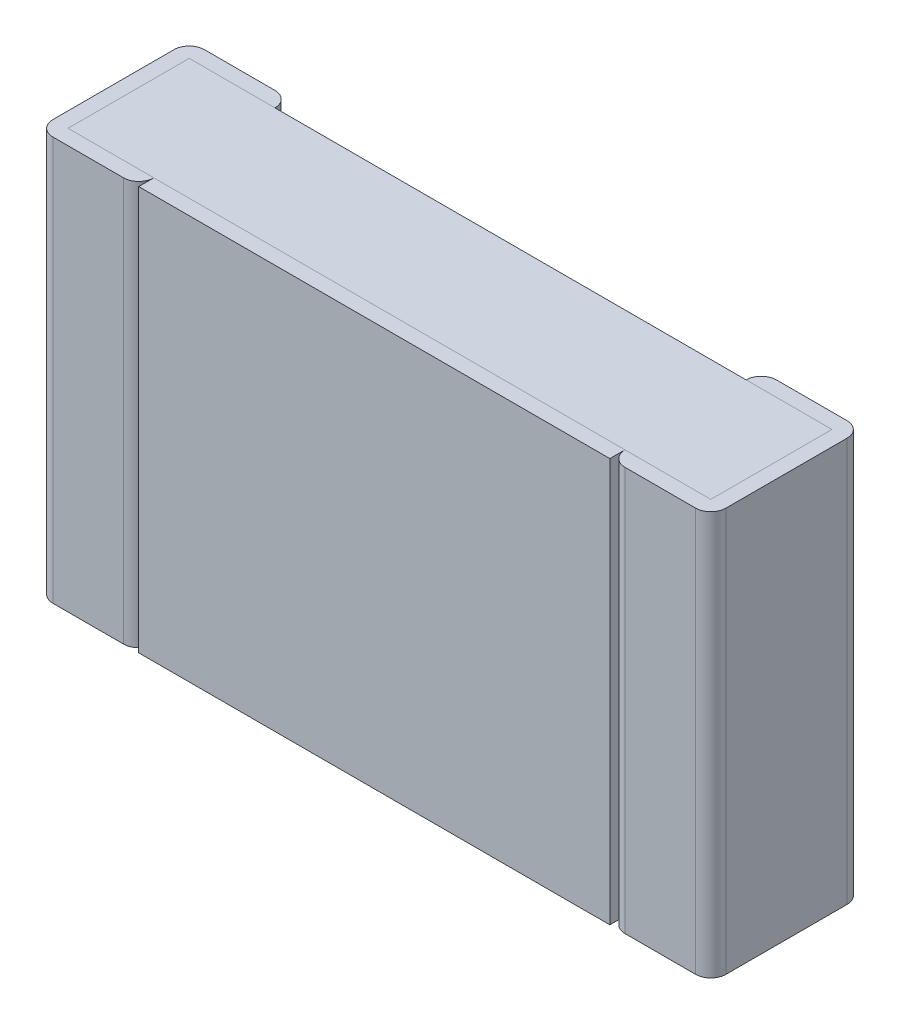
ISO-10303-21;
HEADER;
FILE_DESCRIPTION(('STEP AP214'),'2;1');
FILE_NAME('part.step','',(''),(''),'','','');
FILE_SCHEMA(('AUTOMOTIVE_DESIGN { 1 0 10303 214 1 1 1 1 }'));
ENDSEC;
DATA;
#1=APPLICATION_CONTEXT('core data for automotive mechanical design processes');
#2=APPLICATION_PROTOCOL_DEFINITION('international standard','automotive_design',2000,#1);
#3=PRODUCT_CONTEXT('',#1,'mechanical');
#4=PRODUCT('Part','Part','',(#3));
#5=PRODUCT_RELATED_PRODUCT_CATEGORY('part','',(#4));
#6=PRODUCT_DEFINITION_FORMATION('','',#4);
#7=PRODUCT_DEFINITION_CONTEXT('part definition',#1,'design');
#8=PRODUCT_DEFINITION('design','',#6,#7);
#9=PRODUCT_DEFINITION_SHAPE('','',#8);
#10=(LENGTH_UNIT() NAMED_UNIT(*) SI_UNIT(.MILLI.,.METRE.));
#11=(NAMED_UNIT(*) PLANE_ANGLE_UNIT() SI_UNIT($,.RADIAN.));
#12=(NAMED_UNIT(*) SI_UNIT($,.STERADIAN.) SOLID_ANGLE_UNIT());
#13=UNCERTAINTY_MEASURE_WITH_UNIT(LENGTH_MEASURE(1.E-05),#10,'distance_accuracy_value','');
#14=(GEOMETRIC_REPRESENTATION_CONTEXT(3) GLOBAL_UNCERTAINTY_ASSIGNED_CONTEXT((#13)) GLOBAL_UNIT_ASSIGNED_CONTEXT((#10,
#11,#12)) REPRESENTATION_CONTEXT('',''));
#15=CARTESIAN_POINT('',(0.,0.,0.));
#16=DIRECTION('',(0.,0.,1.));
#17=DIRECTION('',(1.,0.,0.));
#18=AXIS2_PLACEMENT_3D('',#15,#16,#17);
#19=CARTESIAN_POINT('',(-1.,-0.6,0.));
#20=DIRECTION('',(1.,0.,0.));
#21=DIRECTION('',(0.,1.,0.));
#22=AXIS2_PLACEMENT_3D('',#19,#20,#21);
#23=PLANE('',#22);
#24=DIRECTION('',(0.,1.,0.));
#25=VECTOR('',#24,1.);
#26=CARTESIAN_POINT('',(-1.,-0.6,0.405));
#27=LINE('',#26,#25);
#28=CARTESIAN_POINT('',(-1.,-0.6,0.405));
#29=VERTEX_POINT('',#28);
#30=CARTESIAN_POINT('',(-1.,0.6,0.405));
#31=VERTEX_POINT('',#30);
#32=EDGE_CURVE('E11',#29,#31,#27,.T.);
#33=ORIENTED_EDGE('',*,*,#32,.T.);
#34=DIRECTION('',(0.,0.,1.));
#35=VECTOR('',#34,1.);
#36=CARTESIAN_POINT('',(-1.,0.6,0.));
#37=LINE('',#36,#35);
#38=CARTESIAN_POINT('',(-1.,0.6,0.045));
#39=VERTEX_POINT('',#38);
#40=EDGE_CURVE('E41',#39,#31,#37,.T.);
#41=ORIENTED_EDGE('',*,*,#40,.F.);
#42=DIRECTION('',(0.,1.,0.));
#43=VECTOR('',#42,1.);
#44=CARTESIAN_POINT('',(-1.,-0.6,0.045));
#45=LINE('',#44,#43);
#46=CARTESIAN_POINT('',(-1.,-0.6,0.045));
#47=VERTEX_POINT('',#46);
#48=EDGE_CURVE('E280',#47,#39,#45,.T.);
#49=ORIENTED_EDGE('',*,*,#48,.F.);
#50=DIRECTION('',(0.,0.,1.));
#51=VECTOR('',#50,1.);
#52=CARTESIAN_POINT('',(-1.,-0.6,0.));
#53=LINE('',#52,#51);
#54=EDGE_CURVE('E27',#47,#29,#53,.T.);
#55=ORIENTED_EDGE('',*,*,#54,.T.);
#56=EDGE_LOOP('',(#33,#41,#49,#55));
#57=FACE_BOUND('',#56,.T.);
#58=ADVANCED_FACE('F16',(#57),#23,.F.);
#59=CARTESIAN_POINT('',(-1.,-0.6,0.));
#60=DIRECTION('',(0.,1.,0.));
#61=DIRECTION('',(1.,0.,0.));
#62=AXIS2_PLACEMENT_3D('',#59,#60,#61);
#63=PLANE('',#62);
#64=CARTESIAN_POINT('',(-0.745,-0.6,0.045));
#65=DIRECTION('',(0.,1.,0.));
#66=DIRECTION('',(0.,0.,1.));
#67=AXIS2_PLACEMENT_3D('',#64,#65,#66);
#68=CIRCLE('',#67,0.045);
#69=CARTESIAN_POINT('',(-0.7,-0.6,0.045));
#70=VERTEX_POINT('',#69);
#71=CARTESIAN_POINT('',(-0.745,-0.6,0.));
#72=VERTEX_POINT('',#71);
#73=EDGE_CURVE('E273',#70,#72,#68,.T.);
#74=ORIENTED_EDGE('',*,*,#73,.F.);
#75=DIRECTION('',(1.,0.,0.));
#76=VECTOR('',#75,1.);
#77=CARTESIAN_POINT('',(-0.955,-0.6,0.045));
#78=LINE('',#77,#76);
#79=CARTESIAN_POINT('',(-0.955,-0.6,0.045));
#80=VERTEX_POINT('',#79);
#81=EDGE_CURVE('E221',#80,#70,#78,.T.);
#82=ORIENTED_EDGE('',*,*,#81,.F.);
#83=DIRECTION('',(0.,0.,1.));
#84=VECTOR('',#83,1.);
#85=CARTESIAN_POINT('',(-0.955,-0.6,0.045));
#86=LINE('',#85,#84);
#87=CARTESIAN_POINT('',(-0.955,-0.6,0.405));
#88=VERTEX_POINT('',#87);
#89=EDGE_CURVE('E252',#80,#88,#86,.T.);
#90=ORIENTED_EDGE('',*,*,#89,.T.);
#91=DIRECTION('',(1.,0.,0.));
#92=VECTOR('',#91,1.);
#93=CARTESIAN_POINT('',(-0.955,-0.6,0.405));
#94=LINE('',#93,#92);
#95=CARTESIAN_POINT('',(-0.7,-0.6,0.405));
#96=VERTEX_POINT('',#95);
#97=EDGE_CURVE('E303',#88,#96,#94,.T.);
#98=ORIENTED_EDGE('',*,*,#97,.T.);
#99=CARTESIAN_POINT('',(-0.745,-0.6,0.405));
#100=DIRECTION('',(0.,-1.,0.));
#101=DIRECTION('',(0.,0.,1.));
#102=AXIS2_PLACEMENT_3D('',#99,#100,#101);
#103=CIRCLE('',#102,0.045);
#104=CARTESIAN_POINT('',(-0.745,-0.6,0.45));
#105=VERTEX_POINT('',#104);
#106=EDGE_CURVE('E299',#96,#105,#103,.T.);
#107=ORIENTED_EDGE('',*,*,#106,.T.);
#108=DIRECTION('',(1.,0.,0.));
#109=VECTOR('',#108,1.);
#110=CARTESIAN_POINT('',(-1.,-0.6,0.45));
#111=LINE('',#110,#109);
#112=CARTESIAN_POINT('',(-0.955,-0.6,0.45));
#113=VERTEX_POINT('',#112);
#114=EDGE_CURVE('E226',#113,#105,#111,.T.);
#115=ORIENTED_EDGE('',*,*,#114,.F.);
#116=CARTESIAN_POINT('',(-0.955,-0.6,0.405));
#117=DIRECTION('',(0.,1.,0.));
#118=DIRECTION('',(0.,0.,1.));
#119=AXIS2_PLACEMENT_3D('',#116,#117,#118);
#120=CIRCLE('',#119,0.045);
#121=EDGE_CURVE('E394',#29,#113,#120,.T.);
#122=ORIENTED_EDGE('',*,*,#121,.F.);
#123=ORIENTED_EDGE('',*,*,#54,.F.);
#124=CARTESIAN_POINT('',(-0.955,-0.6,0.045));
#125=DIRECTION('',(0.,-1.,0.));
#126=DIRECTION('',(0.,0.,1.));
#127=AXIS2_PLACEMENT_3D('',#124,#125,#126);
#128=CIRCLE('',#127,0.045);
#129=CARTESIAN_POINT('',(-0.955,-0.6,0.));
#130=VERTEX_POINT('',#129);
#131=EDGE_CURVE('E279',#47,#130,#128,.T.);
#132=ORIENTED_EDGE('',*,*,#131,.T.);
#133=DIRECTION('',(1.,0.,0.));
#134=VECTOR('',#133,1.);
#135=CARTESIAN_POINT('',(-1.,-0.6,0.));
#136=LINE('',#135,#134);
#137=EDGE_CURVE('E275',#130,#72,#136,.T.);
#138=ORIENTED_EDGE('',*,*,#137,.T.);
#139=EDGE_LOOP('',(#74,#82,#90,#98,#107,#115,#122,#123,#132,#138));
#140=FACE_BOUND('',#139,.T.);
#141=ADVANCED_FACE('F510',(#140),#63,.F.);
#142=CARTESIAN_POINT('',(-0.955,-0.6,0.045));
#143=DIRECTION('',(0.,1.,0.));
#144=DIRECTION('',(-1.,0.,0.));
#145=AXIS2_PLACEMENT_3D('',#142,#143,#144);
#146=CYLINDRICAL_SURFACE('',#145,0.045);
#147=ORIENTED_EDGE('',*,*,#48,.T.);
#148=CARTESIAN_POINT('',(-0.955,0.6,0.045));
#149=DIRECTION('',(0.,-1.,0.));
#150=DIRECTION('',(0.,0.,1.));
#151=AXIS2_PLACEMENT_3D('',#148,#149,#150);
#152=CIRCLE('',#151,0.045);
#153=CARTESIAN_POINT('',(-0.955,0.6,0.));
#154=VERTEX_POINT('',#153);
#155=EDGE_CURVE('E407',#39,#154,#152,.T.);
#156=ORIENTED_EDGE('',*,*,#155,.T.);
#157=DIRECTION('',(0.,1.,0.));
#158=VECTOR('',#157,1.);
#159=CARTESIAN_POINT('',(-0.955,-0.6,0.));
#160=LINE('',#159,#158);
#161=EDGE_CURVE('E290',#130,#154,#160,.T.);
#162=ORIENTED_EDGE('',*,*,#161,.F.);
#163=ORIENTED_EDGE('',*,*,#131,.F.);
#164=EDGE_LOOP('',(#147,#156,#162,#163));
#165=FACE_BOUND('',#164,.T.);
#166=ADVANCED_FACE('F531',(#165),#146,.T.);
#167=CARTESIAN_POINT('',(-0.955,-0.6,0.405));
#168=DIRECTION('',(0.,1.,0.));
#169=DIRECTION('',(-1.,0.,0.));
#170=AXIS2_PLACEMENT_3D('',#167,#168,#169);
#171=CYLINDRICAL_SURFACE('',#170,0.045);
#172=ORIENTED_EDGE('',*,*,#121,.T.);
#173=DIRECTION('',(0.,1.,0.));
#174=VECTOR('',#173,1.);
#175=CARTESIAN_POINT('',(-0.955,-0.6,0.45));
#176=LINE('',#175,#174);
#177=CARTESIAN_POINT('',(-0.955,0.6,0.45));
#178=VERTEX_POINT('',#177);
#179=EDGE_CURVE('E370',#113,#178,#176,.T.);
#180=ORIENTED_EDGE('',*,*,#179,.T.);
#181=CARTESIAN_POINT('',(-0.955,0.6,0.405));
#182=DIRECTION('',(0.,1.,0.));
#183=DIRECTION('',(0.,0.,1.));
#184=AXIS2_PLACEMENT_3D('',#181,#182,#183);
#185=CIRCLE('',#184,0.045);
#186=EDGE_CURVE('E247',#31,#178,#185,.T.);
#187=ORIENTED_EDGE('',*,*,#186,.F.);
#188=ORIENTED_EDGE('',*,*,#32,.F.);
#189=EDGE_LOOP('',(#172,#180,#187,#188));
#190=FACE_BOUND('',#189,.T.);
#191=ADVANCED_FACE('F540',(#190),#171,.T.);
#192=CARTESIAN_POINT('',(-1.,0.6,0.));
#193=DIRECTION('',(0.,1.,0.));
#194=DIRECTION('',(1.,0.,0.));
#195=AXIS2_PLACEMENT_3D('',#192,#193,#194);
#196=PLANE('',#195);
#197=DIRECTION('',(1.,0.,0.));
#198=VECTOR('',#197,1.);
#199=CARTESIAN_POINT('',(-1.,0.6,0.));
#200=LINE('',#199,#198);
#201=CARTESIAN_POINT('',(-0.745,0.6,0.));
#202=VERTEX_POINT('',#201);
#203=EDGE_CURVE('E294',#154,#202,#200,.T.);
#204=ORIENTED_EDGE('',*,*,#203,.F.);
#205=ORIENTED_EDGE('',*,*,#155,.F.);
#206=ORIENTED_EDGE('',*,*,#40,.T.);
#207=ORIENTED_EDGE('',*,*,#186,.T.);
#208=DIRECTION('',(1.,0.,0.));
#209=VECTOR('',#208,1.);
#210=CARTESIAN_POINT('',(-1.,0.6,0.45));
#211=LINE('',#210,#209);
#212=CARTESIAN_POINT('',(-0.745,0.6,0.45));
#213=VERTEX_POINT('',#212);
#214=EDGE_CURVE('E241',#178,#213,#211,.T.);
#215=ORIENTED_EDGE('',*,*,#214,.T.);
#216=CARTESIAN_POINT('',(-0.745,0.6,0.405));
#217=DIRECTION('',(0.,-1.,0.));
#218=DIRECTION('',(0.,0.,1.));
#219=AXIS2_PLACEMENT_3D('',#216,#217,#218);
#220=CIRCLE('',#219,0.045);
#221=CARTESIAN_POINT('',(-0.7,0.6,0.405));
#222=VERTEX_POINT('',#221);
#223=EDGE_CURVE('E232',#222,#213,#220,.T.);
#224=ORIENTED_EDGE('',*,*,#223,.F.);
#225=DIRECTION('',(1.,0.,0.));
#226=VECTOR('',#225,1.);
#227=CARTESIAN_POINT('',(-0.955,0.6,0.405));
#228=LINE('',#227,#226);
#229=CARTESIAN_POINT('',(-0.955,0.6,0.405));
#230=VERTEX_POINT('',#229);
#231=EDGE_CURVE('E233',#230,#222,#228,.T.);
#232=ORIENTED_EDGE('',*,*,#231,.F.);
#233=DIRECTION('',(0.,0.,1.));
#234=VECTOR('',#233,1.);
#235=CARTESIAN_POINT('',(-0.955,0.6,0.045));
#236=LINE('',#235,#234);
#237=CARTESIAN_POINT('',(-0.955,0.6,0.045));
#238=VERTEX_POINT('',#237);
#239=EDGE_CURVE('E229',#238,#230,#236,.T.);
#240=ORIENTED_EDGE('',*,*,#239,.F.);
#241=DIRECTION('',(1.,0.,0.));
#242=VECTOR('',#241,1.);
#243=CARTESIAN_POINT('',(-0.955,0.6,0.045));
#244=LINE('',#243,#242);
#245=CARTESIAN_POINT('',(-0.7,0.6,0.045));
#246=VERTEX_POINT('',#245);
#247=EDGE_CURVE('E237',#238,#246,#244,.T.);
#248=ORIENTED_EDGE('',*,*,#247,.T.);
#249=CARTESIAN_POINT('',(-0.745,0.6,0.045));
#250=DIRECTION('',(0.,1.,0.));
#251=DIRECTION('',(0.,0.,1.));
#252=AXIS2_PLACEMENT_3D('',#249,#250,#251);
#253=CIRCLE('',#252,0.045);
#254=EDGE_CURVE('E242',#246,#202,#253,.T.);
#255=ORIENTED_EDGE('',*,*,#254,.T.);
#256=EDGE_LOOP('',(#204,#205,#206,#207,#215,#224,#232,#240,#248,#255));
#257=FACE_BOUND('',#256,.T.);
#258=ADVANCED_FACE('F536',(#257),#196,.T.);
#259=CARTESIAN_POINT('',(-1.,-0.6,0.));
#260=DIRECTION('',(0.,0.,1.));
#261=DIRECTION('',(1.,0.,0.));
#262=AXIS2_PLACEMENT_3D('',#259,#260,#261);
#263=PLANE('',#262);
#264=DIRECTION('',(0.,1.,0.));
#265=VECTOR('',#264,1.);
#266=CARTESIAN_POINT('',(-0.745,-0.6,0.));
#267=LINE('',#266,#265);
#268=EDGE_CURVE('E236',#72,#202,#267,.T.);
#269=ORIENTED_EDGE('',*,*,#268,.F.);
#270=ORIENTED_EDGE('',*,*,#137,.F.);
#271=ORIENTED_EDGE('',*,*,#161,.T.);
#272=ORIENTED_EDGE('',*,*,#203,.T.);
#273=EDGE_LOOP('',(#269,#270,#271,#272));
#274=FACE_BOUND('',#273,.T.);
#275=ADVANCED_FACE('F539',(#274),#263,.F.);
#276=CARTESIAN_POINT('',(-0.745,-0.6,0.045));
#277=DIRECTION('',(0.,1.,0.));
#278=DIRECTION('',(1.,0.,0.));
#279=AXIS2_PLACEMENT_3D('',#276,#277,#278);
#280=CYLINDRICAL_SURFACE('',#279,0.045);
#281=ORIENTED_EDGE('',*,*,#73,.T.);
#282=ORIENTED_EDGE('',*,*,#268,.T.);
#283=ORIENTED_EDGE('',*,*,#254,.F.);
#284=DIRECTION('',(0.,1.,0.));
#285=VECTOR('',#284,1.);
#286=CARTESIAN_POINT('',(-0.7,-0.6,0.045));
#287=LINE('',#286,#285);
#288=EDGE_CURVE('E289',#70,#246,#287,.T.);
#289=ORIENTED_EDGE('',*,*,#288,.F.);
#290=EDGE_LOOP('',(#281,#282,#283,#289));
#291=FACE_BOUND('',#290,.T.);
#292=ADVANCED_FACE('F565',(#291),#280,.T.);
#293=CARTESIAN_POINT('',(-0.955,-0.6,0.045));
#294=DIRECTION('',(0.,1.,0.));
#295=DIRECTION('',(1.,0.,0.));
#296=AXIS2_PLACEMENT_3D('',#293,#294,#295);
#297=PLANE('',#296);
#298=DIRECTION('',(1.,0.,0.));
#299=VECTOR('',#298,1.);
#300=CARTESIAN_POINT('',(-0.955,-0.6,0.045));
#301=LINE('',#300,#299);
#302=CARTESIAN_POINT('',(0.7,-0.6,0.045));
#303=VERTEX_POINT('',#302);
#304=EDGE_CURVE('E211',#70,#303,#301,.T.);
#305=ORIENTED_EDGE('',*,*,#304,.T.);
#306=DIRECTION('',(1.,0.,0.));
#307=VECTOR('',#306,1.);
#308=CARTESIAN_POINT('',(-0.955,-0.6,0.045));
#309=LINE('',#308,#307);
#310=CARTESIAN_POINT('',(0.955,-0.6,0.045));
#311=VERTEX_POINT('',#310);
#312=EDGE_CURVE('E203',#303,#311,#309,.T.);
#313=ORIENTED_EDGE('',*,*,#312,.T.);
#314=DIRECTION('',(0.,0.,1.));
#315=VECTOR('',#314,1.);
#316=CARTESIAN_POINT('',(0.955,-0.6,0.045));
#317=LINE('',#316,#315);
#318=CARTESIAN_POINT('',(0.955,-0.6,0.405));
#319=VERTEX_POINT('',#318);
#320=EDGE_CURVE('E207',#311,#319,#317,.T.);
#321=ORIENTED_EDGE('',*,*,#320,.T.);
#322=DIRECTION('',(1.,0.,0.));
#323=VECTOR('',#322,1.);
#324=CARTESIAN_POINT('',(-0.955,-0.6,0.405));
#325=LINE('',#324,#323);
#326=CARTESIAN_POINT('',(0.7,-0.6,0.405));
#327=VERTEX_POINT('',#326);
#328=EDGE_CURVE('E219',#327,#319,#325,.T.);
#329=ORIENTED_EDGE('',*,*,#328,.F.);
#330=DIRECTION('',(1.,0.,0.));
#331=VECTOR('',#330,1.);
#332=CARTESIAN_POINT('',(-0.7,-0.6,0.405));
#333=LINE('',#332,#331);
#334=EDGE_CURVE('E253',#96,#327,#333,.T.);
#335=ORIENTED_EDGE('',*,*,#334,.F.);
#336=ORIENTED_EDGE('',*,*,#97,.F.);
#337=ORIENTED_EDGE('',*,*,#89,.F.);
#338=ORIENTED_EDGE('',*,*,#81,.T.);
#339=EDGE_LOOP('',(#305,#313,#321,#329,#335,#336,#337,#338));
#340=FACE_BOUND('',#339,.T.);
#341=ADVANCED_FACE('F205',(#340),#297,.F.);
#342=CARTESIAN_POINT('',(-1.,-0.6,0.45));
#343=DIRECTION('',(0.,0.,1.));
#344=DIRECTION('',(1.,0.,0.));
#345=AXIS2_PLACEMENT_3D('',#342,#343,#344);
#346=PLANE('',#345);
#347=ORIENTED_EDGE('',*,*,#214,.F.);
#348=ORIENTED_EDGE('',*,*,#179,.F.);
#349=ORIENTED_EDGE('',*,*,#114,.T.);
#350=DIRECTION('',(0.,1.,0.));
#351=VECTOR('',#350,1.);
#352=CARTESIAN_POINT('',(-0.745,-0.6,0.45));
#353=LINE('',#352,#351);
#354=EDGE_CURVE('E382',#105,#213,#353,.T.);
#355=ORIENTED_EDGE('',*,*,#354,.T.);
#356=EDGE_LOOP('',(#347,#348,#349,#355));
#357=FACE_BOUND('',#356,.T.);
#358=ADVANCED_FACE('F564',(#357),#346,.T.);
#359=CARTESIAN_POINT('',(-0.745,-0.6,0.405));
#360=DIRECTION('',(0.,1.,0.));
#361=DIRECTION('',(1.,0.,0.));
#362=AXIS2_PLACEMENT_3D('',#359,#360,#361);
#363=CYLINDRICAL_SURFACE('',#362,0.045);
#364=DIRECTION('',(0.,1.,0.));
#365=VECTOR('',#364,1.);
#366=CARTESIAN_POINT('',(-0.7,-0.6,0.405));
#367=LINE('',#366,#365);
#368=EDGE_CURVE('E362',#96,#222,#367,.T.);
#369=ORIENTED_EDGE('',*,*,#368,.T.);
#370=ORIENTED_EDGE('',*,*,#223,.T.);
#371=ORIENTED_EDGE('',*,*,#354,.F.);
#372=ORIENTED_EDGE('',*,*,#106,.F.);
#373=EDGE_LOOP('',(#369,#370,#371,#372));
#374=FACE_BOUND('',#373,.T.);
#375=ADVANCED_FACE('F507',(#374),#363,.T.);
#376=CARTESIAN_POINT('',(-0.955,0.6,0.045));
#377=DIRECTION('',(0.,1.,0.));
#378=DIRECTION('',(1.,0.,0.));
#379=AXIS2_PLACEMENT_3D('',#376,#377,#378);
#380=PLANE('',#379);
#381=ORIENTED_EDGE('',*,*,#247,.F.);
#382=ORIENTED_EDGE('',*,*,#239,.T.);
#383=ORIENTED_EDGE('',*,*,#231,.T.);
#384=DIRECTION('',(1.,0.,0.));
#385=VECTOR('',#384,1.);
#386=CARTESIAN_POINT('',(-0.7,0.6,0.405));
#387=LINE('',#386,#385);
#388=CARTESIAN_POINT('',(0.7,0.6,0.405));
#389=VERTEX_POINT('',#388);
#390=EDGE_CURVE('E349',#222,#389,#387,.T.);
#391=ORIENTED_EDGE('',*,*,#390,.T.);
#392=DIRECTION('',(1.,0.,0.));
#393=VECTOR('',#392,1.);
#394=CARTESIAN_POINT('',(-0.955,0.6,0.405));
#395=LINE('',#394,#393);
#396=CARTESIAN_POINT('',(0.955,0.6,0.405));
#397=VERTEX_POINT('',#396);
#398=EDGE_CURVE('E411',#389,#397,#395,.T.);
#399=ORIENTED_EDGE('',*,*,#398,.T.);
#400=DIRECTION('',(0.,0.,1.));
#401=VECTOR('',#400,1.);
#402=CARTESIAN_POINT('',(0.955,0.6,0.045));
#403=LINE('',#402,#401);
#404=CARTESIAN_POINT('',(0.955,0.6,0.045));
#405=VERTEX_POINT('',#404);
#406=EDGE_CURVE('E262',#405,#397,#403,.T.);
#407=ORIENTED_EDGE('',*,*,#406,.F.);
#408=DIRECTION('',(1.,0.,0.));
#409=VECTOR('',#408,1.);
#410=CARTESIAN_POINT('',(-0.955,0.6,0.045));
#411=LINE('',#410,#409);
#412=CARTESIAN_POINT('',(0.7,0.6,0.045));
#413=VERTEX_POINT('',#412);
#414=EDGE_CURVE('E353',#413,#405,#411,.T.);
#415=ORIENTED_EDGE('',*,*,#414,.F.);
#416=DIRECTION('',(1.,0.,0.));
#417=VECTOR('',#416,1.);
#418=CARTESIAN_POINT('',(-0.955,0.6,0.045));
#419=LINE('',#418,#417);
#420=EDGE_CURVE('E388',#246,#413,#419,.T.);
#421=ORIENTED_EDGE('',*,*,#420,.F.);
#422=EDGE_LOOP('',(#381,#382,#383,#391,#399,#407,#415,#421));
#423=FACE_BOUND('',#422,.T.);
#424=ADVANCED_FACE('F494',(#423),#380,.T.);
#425=CARTESIAN_POINT('',(-0.955,-0.6,0.045));
#426=DIRECTION('',(0.,0.,1.));
#427=DIRECTION('',(1.,0.,0.));
#428=AXIS2_PLACEMENT_3D('',#425,#426,#427);
#429=PLANE('',#428);
#430=ORIENTED_EDGE('',*,*,#420,.T.);
#431=DIRECTION('',(0.,1.,0.));
#432=VECTOR('',#431,1.);
#433=CARTESIAN_POINT('',(0.7,-0.6,0.045));
#434=LINE('',#433,#432);
#435=EDGE_CURVE('E319',#303,#413,#434,.T.);
#436=ORIENTED_EDGE('',*,*,#435,.F.);
#437=ORIENTED_EDGE('',*,*,#304,.F.);
#438=ORIENTED_EDGE('',*,*,#288,.T.);
#439=EDGE_LOOP('',(#430,#436,#437,#438));
#440=FACE_BOUND('',#439,.T.);
#441=ADVANCED_FACE('F520',(#440),#429,.F.);
#442=CARTESIAN_POINT('',(0.7,-0.6,0.));
#443=DIRECTION('',(0.,1.,0.));
#444=DIRECTION('',(1.,0.,0.));
#445=AXIS2_PLACEMENT_3D('',#442,#443,#444);
#446=PLANE('',#445);
#447=CARTESIAN_POINT('',(0.955,-0.6,0.045));
#448=DIRECTION('',(0.,1.,0.));
#449=DIRECTION('',(0.,0.,1.));
#450=AXIS2_PLACEMENT_3D('',#447,#448,#449);
#451=CIRCLE('',#450,0.045);
#452=CARTESIAN_POINT('',(1.,-0.6,0.045));
#453=VERTEX_POINT('',#452);
#454=CARTESIAN_POINT('',(0.955,-0.6,0.));
#455=VERTEX_POINT('',#454);
#456=EDGE_CURVE('E295',#453,#455,#451,.T.);
#457=ORIENTED_EDGE('',*,*,#456,.F.);
#458=DIRECTION('',(0.,0.,1.));
#459=VECTOR('',#458,1.);
#460=CARTESIAN_POINT('',(1.,-0.6,0.));
#461=LINE('',#460,#459);
#462=CARTESIAN_POINT('',(1.,-0.6,0.405));
#463=VERTEX_POINT('',#462);
#464=EDGE_CURVE('E267',#453,#463,#461,.T.);
#465=ORIENTED_EDGE('',*,*,#464,.T.);
#466=CARTESIAN_POINT('',(0.955,-0.6,0.405));
#467=DIRECTION('',(0.,-1.,0.));
#468=DIRECTION('',(0.,0.,1.));
#469=AXIS2_PLACEMENT_3D('',#466,#467,#468);
#470=CIRCLE('',#469,0.045);
#471=CARTESIAN_POINT('',(0.955,-0.6,0.45));
#472=VERTEX_POINT('',#471);
#473=EDGE_CURVE('E245',#463,#472,#470,.T.);
#474=ORIENTED_EDGE('',*,*,#473,.T.);
#475=DIRECTION('',(1.,0.,0.));
#476=VECTOR('',#475,1.);
#477=CARTESIAN_POINT('',(0.7,-0.6,0.45));
#478=LINE('',#477,#476);
#479=CARTESIAN_POINT('',(0.745,-0.6,0.45));
#480=VERTEX_POINT('',#479);
#481=EDGE_CURVE('E308',#480,#472,#478,.T.);
#482=ORIENTED_EDGE('',*,*,#481,.F.);
#483=CARTESIAN_POINT('',(0.745,-0.6,0.405));
#484=DIRECTION('',(0.,1.,0.));
#485=DIRECTION('',(0.,0.,1.));
#486=AXIS2_PLACEMENT_3D('',#483,#484,#485);
#487=CIRCLE('',#486,0.045);
#488=EDGE_CURVE('E285',#327,#480,#487,.T.);
#489=ORIENTED_EDGE('',*,*,#488,.F.);
#490=ORIENTED_EDGE('',*,*,#328,.T.);
#491=ORIENTED_EDGE('',*,*,#320,.F.);
#492=ORIENTED_EDGE('',*,*,#312,.F.);
#493=CARTESIAN_POINT('',(0.745,-0.6,0.045));
#494=DIRECTION('',(0.,-1.,0.));
#495=DIRECTION('',(0.,0.,1.));
#496=AXIS2_PLACEMENT_3D('',#493,#494,#495);
#497=CIRCLE('',#496,0.045);
#498=CARTESIAN_POINT('',(0.745,-0.6,0.));
#499=VERTEX_POINT('',#498);
#500=EDGE_CURVE('E246',#303,#499,#497,.T.);
#501=ORIENTED_EDGE('',*,*,#500,.T.);
#502=DIRECTION('',(1.,0.,0.));
#503=VECTOR('',#502,1.);
#504=CARTESIAN_POINT('',(0.7,-0.6,0.));
#505=LINE('',#504,#503);
#506=EDGE_CURVE('E314',#499,#455,#505,.T.);
#507=ORIENTED_EDGE('',*,*,#506,.T.);
#508=EDGE_LOOP('',(#457,#465,#474,#482,#489,#490,#491,#492,#501,#507));
#509=FACE_BOUND('',#508,.T.);
#510=ADVANCED_FACE('F218',(#509),#446,.F.);
#511=CARTESIAN_POINT('',(-0.7,-0.6,0.405));
#512=DIRECTION('',(0.,1.,0.));
#513=DIRECTION('',(1.,0.,0.));
#514=AXIS2_PLACEMENT_3D('',#511,#512,#513);
#515=PLANE('',#514);
#516=DIRECTION('',(0.,0.,1.));
#517=VECTOR('',#516,1.);
#518=CARTESIAN_POINT('',(0.7,-0.6,0.405));
#519=LINE('',#518,#517);
#520=CARTESIAN_POINT('',(0.7,-0.6,0.45));
#521=VERTEX_POINT('',#520);
#522=EDGE_CURVE('E20',#327,#521,#519,.T.);
#523=ORIENTED_EDGE('',*,*,#522,.T.);
#524=DIRECTION('',(1.,0.,0.));
#525=VECTOR('',#524,1.);
#526=CARTESIAN_POINT('',(-0.7,-0.6,0.45));
#527=LINE('',#526,#525);
#528=CARTESIAN_POINT('',(-0.7,-0.6,0.45));
#529=VERTEX_POINT('',#528);
#530=EDGE_CURVE('E121',#529,#521,#527,.T.);
#531=ORIENTED_EDGE('',*,*,#530,.F.);
#532=DIRECTION('',(0.,0.,1.));
#533=VECTOR('',#532,1.);
#534=CARTESIAN_POINT('',(-0.7,-0.6,0.405));
#535=LINE('',#534,#533);
#536=EDGE_CURVE('E328',#96,#529,#535,.T.);
#537=ORIENTED_EDGE('',*,*,#536,.F.);
#538=ORIENTED_EDGE('',*,*,#334,.T.);
#539=EDGE_LOOP('',(#523,#531,#537,#538));
#540=FACE_BOUND('',#539,.T.);
#541=ADVANCED_FACE('F511',(#540),#515,.F.);
#542=CARTESIAN_POINT('',(-0.7,-0.6,0.405));
#543=DIRECTION('',(1.,0.,0.));
#544=DIRECTION('',(0.,1.,0.));
#545=AXIS2_PLACEMENT_3D('',#542,#543,#544);
#546=PLANE('',#545);
#547=DIRECTION('',(0.,1.,0.));
#548=VECTOR('',#547,1.);
#549=CARTESIAN_POINT('',(-0.7,-0.6,0.45));
#550=LINE('',#549,#548);
#551=CARTESIAN_POINT('',(-0.7,0.6,0.45));
#552=VERTEX_POINT('',#551);
#553=EDGE_CURVE('E257',#529,#552,#550,.T.);
#554=ORIENTED_EDGE('',*,*,#553,.T.);
#555=DIRECTION('',(0.,0.,1.));
#556=VECTOR('',#555,1.);
#557=CARTESIAN_POINT('',(-0.7,0.6,0.405));
#558=LINE('',#557,#556);
#559=EDGE_CURVE('E318',#222,#552,#558,.T.);
#560=ORIENTED_EDGE('',*,*,#559,.F.);
#561=ORIENTED_EDGE('',*,*,#368,.F.);
#562=ORIENTED_EDGE('',*,*,#536,.T.);
#563=EDGE_LOOP('',(#554,#560,#561,#562));
#564=FACE_BOUND('',#563,.T.);
#565=ADVANCED_FACE('F504',(#564),#546,.F.);
#566=CARTESIAN_POINT('',(0.7,0.6,0.));
#567=DIRECTION('',(0.,1.,0.));
#568=DIRECTION('',(1.,0.,0.));
#569=AXIS2_PLACEMENT_3D('',#566,#567,#568);
#570=PLANE('',#569);
#571=DIRECTION('',(1.,0.,0.));
#572=VECTOR('',#571,1.);
#573=CARTESIAN_POINT('',(0.7,0.6,0.));
#574=LINE('',#573,#572);
#575=CARTESIAN_POINT('',(0.745,0.6,0.));
#576=VERTEX_POINT('',#575);
#577=CARTESIAN_POINT('',(0.955,0.6,0.));
#578=VERTEX_POINT('',#577);
#579=EDGE_CURVE('E90',#576,#578,#574,.T.);
#580=ORIENTED_EDGE('',*,*,#579,.F.);
#581=CARTESIAN_POINT('',(0.745,0.6,0.045));
#582=DIRECTION('',(0.,-1.,0.));
#583=DIRECTION('',(0.,0.,1.));
#584=AXIS2_PLACEMENT_3D('',#581,#582,#583);
#585=CIRCLE('',#584,0.045);
#586=EDGE_CURVE('E345',#413,#576,#585,.T.);
#587=ORIENTED_EDGE('',*,*,#586,.F.);
#588=ORIENTED_EDGE('',*,*,#414,.T.);
#589=ORIENTED_EDGE('',*,*,#406,.T.);
#590=ORIENTED_EDGE('',*,*,#398,.F.);
#591=CARTESIAN_POINT('',(0.745,0.6,0.405));
#592=DIRECTION('',(0.,1.,0.));
#593=DIRECTION('',(0.,0.,1.));
#594=AXIS2_PLACEMENT_3D('',#591,#592,#593);
#595=CIRCLE('',#594,0.045);
#596=CARTESIAN_POINT('',(0.745,0.6,0.45));
#597=VERTEX_POINT('',#596);
#598=EDGE_CURVE('E258',#389,#597,#595,.T.);
#599=ORIENTED_EDGE('',*,*,#598,.T.);
#600=DIRECTION('',(1.,0.,0.));
#601=VECTOR('',#600,1.);
#602=CARTESIAN_POINT('',(0.7,0.6,0.45));
#603=LINE('',#602,#601);
#604=CARTESIAN_POINT('',(0.955,0.6,0.45));
#605=VERTEX_POINT('',#604);
#606=EDGE_CURVE('E263',#597,#605,#603,.T.);
#607=ORIENTED_EDGE('',*,*,#606,.T.);
#608=CARTESIAN_POINT('',(0.955,0.6,0.405));
#609=DIRECTION('',(0.,-1.,0.));
#610=DIRECTION('',(0.,0.,1.));
#611=AXIS2_PLACEMENT_3D('',#608,#609,#610);
#612=CIRCLE('',#611,0.045);
#613=CARTESIAN_POINT('',(1.,0.6,0.405));
#614=VERTEX_POINT('',#613);
#615=EDGE_CURVE('E338',#614,#605,#612,.T.);
#616=ORIENTED_EDGE('',*,*,#615,.F.);
#617=DIRECTION('',(0.,0.,1.));
#618=VECTOR('',#617,1.);
#619=CARTESIAN_POINT('',(1.,0.6,0.));
#620=LINE('',#619,#618);
#621=CARTESIAN_POINT('',(1.,0.6,0.045));
#622=VERTEX_POINT('',#621);
#623=EDGE_CURVE('E324',#622,#614,#620,.T.);
#624=ORIENTED_EDGE('',*,*,#623,.F.);
#625=CARTESIAN_POINT('',(0.955,0.6,0.045));
#626=DIRECTION('',(0.,1.,0.));
#627=DIRECTION('',(0.,0.,1.));
#628=AXIS2_PLACEMENT_3D('',#625,#626,#627);
#629=CIRCLE('',#628,0.045);
#630=EDGE_CURVE('E432',#622,#578,#629,.T.);
#631=ORIENTED_EDGE('',*,*,#630,.T.);
#632=EDGE_LOOP('',(#580,#587,#588,#589,#590,#599,#607,#616,#624,#631));
#633=FACE_BOUND('',#632,.T.);
#634=ADVANCED_FACE('F452',(#633),#570,.T.);
#635=CARTESIAN_POINT('',(-0.7,0.6,0.405));
#636=DIRECTION('',(0.,1.,0.));
#637=DIRECTION('',(1.,0.,0.));
#638=AXIS2_PLACEMENT_3D('',#635,#636,#637);
#639=PLANE('',#638);
#640=ORIENTED_EDGE('',*,*,#390,.F.);
#641=ORIENTED_EDGE('',*,*,#559,.T.);
#642=DIRECTION('',(1.,0.,0.));
#643=VECTOR('',#642,1.);
#644=CARTESIAN_POINT('',(-0.7,0.6,0.45));
#645=LINE('',#644,#643);
#646=CARTESIAN_POINT('',(0.7,0.6,0.45));
#647=VERTEX_POINT('',#646);
#648=EDGE_CURVE('E315',#552,#647,#645,.T.);
#649=ORIENTED_EDGE('',*,*,#648,.T.);
#650=DIRECTION('',(0.,0.,1.));
#651=VECTOR('',#650,1.);
#652=CARTESIAN_POINT('',(0.7,0.6,0.405));
#653=LINE('',#652,#651);
#654=EDGE_CURVE('E104',#389,#647,#653,.T.);
#655=ORIENTED_EDGE('',*,*,#654,.F.);
#656=EDGE_LOOP('',(#640,#641,#649,#655));
#657=FACE_BOUND('',#656,.T.);
#658=ADVANCED_FACE('F487',(#657),#639,.T.);
#659=CARTESIAN_POINT('',(0.745,-0.6,0.045));
#660=DIRECTION('',(0.,1.,0.));
#661=DIRECTION('',(-1.,0.,0.));
#662=AXIS2_PLACEMENT_3D('',#659,#660,#661);
#663=CYLINDRICAL_SURFACE('',#662,0.045);
#664=ORIENTED_EDGE('',*,*,#435,.T.);
#665=ORIENTED_EDGE('',*,*,#586,.T.);
#666=DIRECTION('',(0.,1.,0.));
#667=VECTOR('',#666,1.);
#668=CARTESIAN_POINT('',(0.745,-0.6,0.));
#669=LINE('',#668,#667);
#670=EDGE_CURVE('E342',#499,#576,#669,.T.);
#671=ORIENTED_EDGE('',*,*,#670,.F.);
#672=ORIENTED_EDGE('',*,*,#500,.F.);
#673=EDGE_LOOP('',(#664,#665,#671,#672));
#674=FACE_BOUND('',#673,.T.);
#675=ADVANCED_FACE('F463',(#674),#663,.T.);
#676=CARTESIAN_POINT('',(0.7,-0.6,0.));
#677=DIRECTION('',(0.,0.,1.));
#678=DIRECTION('',(1.,0.,0.));
#679=AXIS2_PLACEMENT_3D('',#676,#677,#678);
#680=PLANE('',#679);
#681=DIRECTION('',(0.,1.,0.));
#682=VECTOR('',#681,1.);
#683=CARTESIAN_POINT('',(0.955,-0.6,0.));
#684=LINE('',#683,#682);
#685=EDGE_CURVE('E298',#455,#578,#684,.T.);
#686=ORIENTED_EDGE('',*,*,#685,.F.);
#687=ORIENTED_EDGE('',*,*,#506,.F.);
#688=ORIENTED_EDGE('',*,*,#670,.T.);
#689=ORIENTED_EDGE('',*,*,#579,.T.);
#690=EDGE_LOOP('',(#686,#687,#688,#689));
#691=FACE_BOUND('',#690,.T.);
#692=ADVANCED_FACE('F458',(#691),#680,.F.);
#693=CARTESIAN_POINT('',(0.955,-0.6,0.045));
#694=DIRECTION('',(0.,1.,0.));
#695=DIRECTION('',(1.,0.,0.));
#696=AXIS2_PLACEMENT_3D('',#693,#694,#695);
#697=CYLINDRICAL_SURFACE('',#696,0.045);
#698=ORIENTED_EDGE('',*,*,#456,.T.);
#699=ORIENTED_EDGE('',*,*,#685,.T.);
#700=ORIENTED_EDGE('',*,*,#630,.F.);
#701=DIRECTION('',(0.,1.,0.));
#702=VECTOR('',#701,1.);
#703=CARTESIAN_POINT('',(1.,-0.6,0.045));
#704=LINE('',#703,#702);
#705=EDGE_CURVE('E320',#453,#622,#704,.T.);
#706=ORIENTED_EDGE('',*,*,#705,.F.);
#707=EDGE_LOOP('',(#698,#699,#700,#706));
#708=FACE_BOUND('',#707,.T.);
#709=ADVANCED_FACE('F456',(#708),#697,.T.);
#710=CARTESIAN_POINT('',(1.,-0.6,0.));
#711=DIRECTION('',(1.,0.,0.));
#712=DIRECTION('',(0.,1.,0.));
#713=AXIS2_PLACEMENT_3D('',#710,#711,#712);
#714=PLANE('',#713);
#715=ORIENTED_EDGE('',*,*,#464,.F.);
#716=ORIENTED_EDGE('',*,*,#705,.T.);
#717=ORIENTED_EDGE('',*,*,#623,.T.);
#718=DIRECTION('',(0.,1.,0.));
#719=VECTOR('',#718,1.);
#720=CARTESIAN_POINT('',(1.,-0.6,0.405));
#721=LINE('',#720,#719);
#722=EDGE_CURVE('E334',#463,#614,#721,.T.);
#723=ORIENTED_EDGE('',*,*,#722,.F.);
#724=EDGE_LOOP('',(#715,#716,#717,#723));
#725=FACE_BOUND('',#724,.T.);
#726=ADVANCED_FACE('F771',(#725),#714,.T.);
#727=CARTESIAN_POINT('',(0.955,-0.6,0.405));
#728=DIRECTION('',(0.,1.,0.));
#729=DIRECTION('',(1.,0.,0.));
#730=AXIS2_PLACEMENT_3D('',#727,#728,#729);
#731=CYLINDRICAL_SURFACE('',#730,0.045);
#732=ORIENTED_EDGE('',*,*,#722,.T.);
#733=ORIENTED_EDGE('',*,*,#615,.T.);
#734=DIRECTION('',(0.,1.,0.));
#735=VECTOR('',#734,1.);
#736=CARTESIAN_POINT('',(0.955,-0.6,0.45));
#737=LINE('',#736,#735);
#738=EDGE_CURVE('E304',#472,#605,#737,.T.);
#739=ORIENTED_EDGE('',*,*,#738,.F.);
#740=ORIENTED_EDGE('',*,*,#473,.F.);
#741=EDGE_LOOP('',(#732,#733,#739,#740));
#742=FACE_BOUND('',#741,.T.);
#743=ADVANCED_FACE('F18',(#742),#731,.T.);
#744=CARTESIAN_POINT('',(0.7,-0.6,0.45));
#745=DIRECTION('',(0.,0.,1.));
#746=DIRECTION('',(1.,0.,0.));
#747=AXIS2_PLACEMENT_3D('',#744,#745,#746);
#748=PLANE('',#747);
#749=ORIENTED_EDGE('',*,*,#606,.F.);
#750=DIRECTION('',(0.,1.,0.));
#751=VECTOR('',#750,1.);
#752=CARTESIAN_POINT('',(0.745,-0.6,0.45));
#753=LINE('',#752,#751);
#754=EDGE_CURVE('E281',#480,#597,#753,.T.);
#755=ORIENTED_EDGE('',*,*,#754,.F.);
#756=ORIENTED_EDGE('',*,*,#481,.T.);
#757=ORIENTED_EDGE('',*,*,#738,.T.);
#758=EDGE_LOOP('',(#749,#755,#756,#757));
#759=FACE_BOUND('',#758,.T.);
#760=ADVANCED_FACE('F545',(#759),#748,.T.);
#761=CARTESIAN_POINT('',(0.745,-0.6,0.405));
#762=DIRECTION('',(0.,1.,0.));
#763=DIRECTION('',(-1.,0.,0.));
#764=AXIS2_PLACEMENT_3D('',#761,#762,#763);
#765=CYLINDRICAL_SURFACE('',#764,0.045);
#766=ORIENTED_EDGE('',*,*,#488,.T.);
#767=ORIENTED_EDGE('',*,*,#754,.T.);
#768=ORIENTED_EDGE('',*,*,#598,.F.);
#769=DIRECTION('',(0.,1.,0.));
#770=VECTOR('',#769,1.);
#771=CARTESIAN_POINT('',(0.7,-0.6,0.405));
#772=LINE('',#771,#770);
#773=EDGE_CURVE('E270',#327,#389,#772,.T.);
#774=ORIENTED_EDGE('',*,*,#773,.F.);
#775=EDGE_LOOP('',(#766,#767,#768,#774));
#776=FACE_BOUND('',#775,.T.);
#777=ADVANCED_FACE('F491',(#776),#765,.T.);
#778=CARTESIAN_POINT('',(0.7,-0.6,0.405));
#779=DIRECTION('',(1.,0.,0.));
#780=DIRECTION('',(0.,1.,0.));
#781=AXIS2_PLACEMENT_3D('',#778,#779,#780);
#782=PLANE('',#781);
#783=ORIENTED_EDGE('',*,*,#522,.F.);
#784=ORIENTED_EDGE('',*,*,#773,.T.);
#785=ORIENTED_EDGE('',*,*,#654,.T.);
#786=DIRECTION('',(0.,1.,0.));
#787=VECTOR('',#786,1.);
#788=CARTESIAN_POINT('',(0.7,-0.6,0.45));
#789=LINE('',#788,#787);
#790=EDGE_CURVE('E311',#521,#647,#789,.T.);
#791=ORIENTED_EDGE('',*,*,#790,.F.);
#792=EDGE_LOOP('',(#783,#784,#785,#791));
#793=FACE_BOUND('',#792,.T.);
#794=ADVANCED_FACE('F497',(#793),#782,.T.);
#795=CARTESIAN_POINT('',(-0.7,-0.6,0.45));
#796=DIRECTION('',(0.,0.,1.));
#797=DIRECTION('',(1.,0.,0.));
#798=AXIS2_PLACEMENT_3D('',#795,#796,#797);
#799=PLANE('',#798);
#800=ORIENTED_EDGE('',*,*,#553,.F.);
#801=ORIENTED_EDGE('',*,*,#530,.T.);
#802=ORIENTED_EDGE('',*,*,#790,.T.);
#803=ORIENTED_EDGE('',*,*,#648,.F.);
#804=EDGE_LOOP('',(#800,#801,#802,#803));
#805=FACE_BOUND('',#804,.T.);
#806=ADVANCED_FACE('F550',(#805),#799,.T.);
#807=CLOSED_SHELL('',(#58,#141,#166,#191,#258,#275,#292,#341,#358,#375,#424,#441,#510,#541,#565,
#634,#658,#675,#692,#709,#726,#743,#760,#777,#794,#806));
#808=MANIFOLD_SOLID_BREP('B1',#807);
#809=ADVANCED_BREP_SHAPE_REPRESENTATION('',(#18,#808),#14);
#810=SHAPE_DEFINITION_REPRESENTATION(#9,#809);
ENDSEC;
END-ISO-10303-21;
